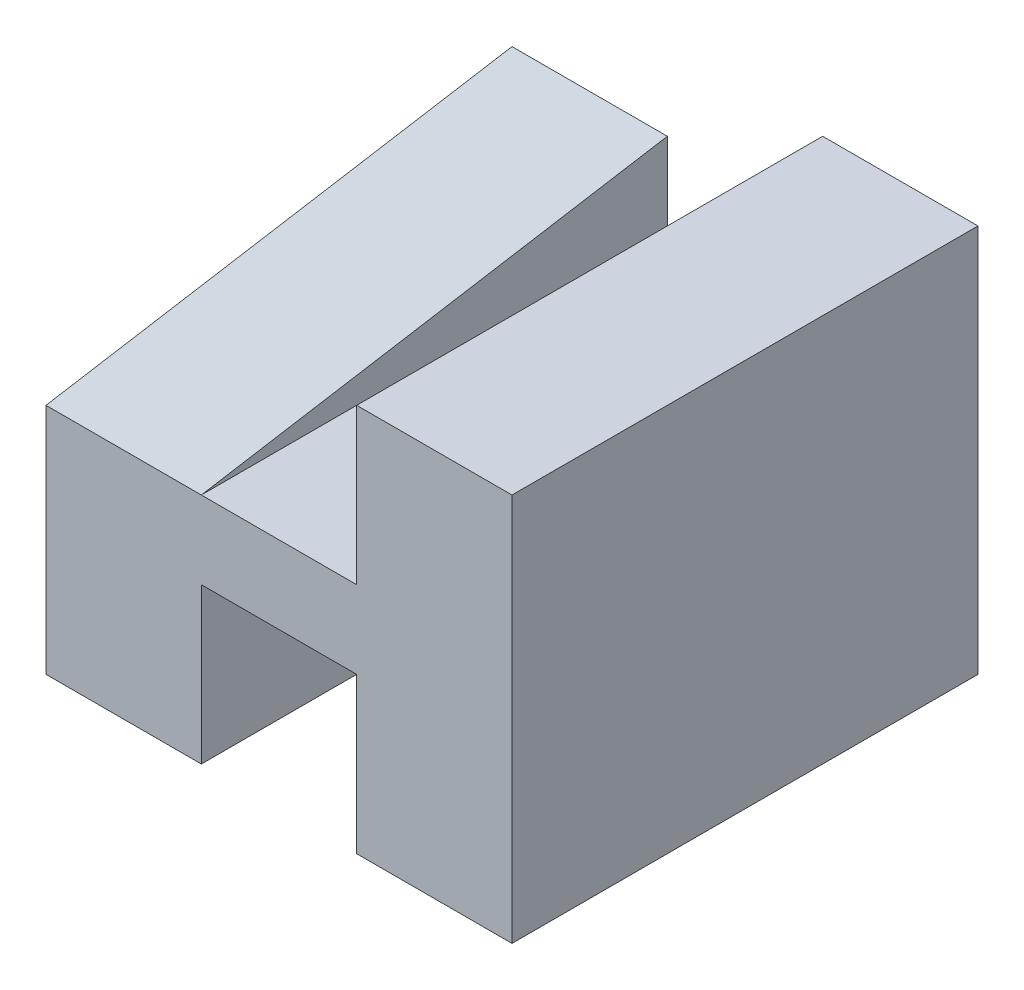
ISO-10303-21;
HEADER;
FILE_DESCRIPTION(('STEP AP214'),'2;1');
FILE_NAME('part.step','',(''),(''),'','','');
FILE_SCHEMA(('AUTOMOTIVE_DESIGN { 1 0 10303 214 1 1 1 1 }'));
ENDSEC;
DATA;
#1=APPLICATION_CONTEXT('core data for automotive mechanical design processes');
#2=APPLICATION_PROTOCOL_DEFINITION('international standard','automotive_design',2000,#1);
#3=PRODUCT_CONTEXT('',#1,'mechanical');
#4=PRODUCT('Part','Part','',(#3));
#5=PRODUCT_RELATED_PRODUCT_CATEGORY('part','',(#4));
#6=PRODUCT_DEFINITION_FORMATION('','',#4);
#7=PRODUCT_DEFINITION_CONTEXT('part definition',#1,'design');
#8=PRODUCT_DEFINITION('design','',#6,#7);
#9=PRODUCT_DEFINITION_SHAPE('','',#8);
#10=(LENGTH_UNIT() NAMED_UNIT(*) SI_UNIT(.MILLI.,.METRE.));
#11=(NAMED_UNIT(*) PLANE_ANGLE_UNIT() SI_UNIT($,.RADIAN.));
#12=(NAMED_UNIT(*) SI_UNIT($,.STERADIAN.) SOLID_ANGLE_UNIT());
#13=UNCERTAINTY_MEASURE_WITH_UNIT(LENGTH_MEASURE(1.E-05),#10,'distance_accuracy_value','');
#14=(GEOMETRIC_REPRESENTATION_CONTEXT(3) GLOBAL_UNCERTAINTY_ASSIGNED_CONTEXT((#13)) GLOBAL_UNIT_ASSIGNED_CONTEXT((#10,
#11,#12)) REPRESENTATION_CONTEXT('',''));
#15=CARTESIAN_POINT('',(0.,0.,0.));
#16=DIRECTION('',(0.,0.,1.));
#17=DIRECTION('',(1.,0.,0.));
#18=AXIS2_PLACEMENT_3D('',#15,#16,#17);
#19=CARTESIAN_POINT('',(-3.,5.,-3.));
#20=DIRECTION('',(0.,0.,1.));
#21=DIRECTION('',(1.,0.,0.));
#22=AXIS2_PLACEMENT_3D('',#19,#20,#21);
#23=PLANE('',#22);
#24=DIRECTION('',(-1.,0.,0.));
#25=VECTOR('',#24,1.);
#26=CARTESIAN_POINT('',(-1.,4.,-3.));
#27=LINE('',#26,#25);
#28=CARTESIAN_POINT('',(-1.,4.,-3.));
#29=VERTEX_POINT('',#28);
#30=CARTESIAN_POINT('',(-3.,4.,-3.));
#31=VERTEX_POINT('',#30);
#32=EDGE_CURVE('E116',#29,#31,#27,.T.);
#33=ORIENTED_EDGE('',*,*,#32,.F.);
#34=DIRECTION('',(0.,1.,0.));
#35=VECTOR('',#34,1.);
#36=CARTESIAN_POINT('',(-1.,3.,-3.));
#37=LINE('',#36,#35);
#38=CARTESIAN_POINT('',(-1.,3.,-3.));
#39=VERTEX_POINT('',#38);
#40=EDGE_CURVE('E130',#39,#29,#37,.T.);
#41=ORIENTED_EDGE('',*,*,#40,.F.);
#42=DIRECTION('',(1.,0.,0.));
#43=VECTOR('',#42,1.);
#44=CARTESIAN_POINT('',(-1.,3.,-3.));
#45=LINE('',#44,#43);
#46=CARTESIAN_POINT('',(1.,3.,-3.));
#47=VERTEX_POINT('',#46);
#48=EDGE_CURVE('E151',#39,#47,#45,.T.);
#49=ORIENTED_EDGE('',*,*,#48,.T.);
#50=DIRECTION('',(0.,1.,0.));
#51=VECTOR('',#50,1.);
#52=CARTESIAN_POINT('',(1.,3.,-3.));
#53=LINE('',#52,#51);
#54=CARTESIAN_POINT('',(1.,5.,-3.));
#55=VERTEX_POINT('',#54);
#56=EDGE_CURVE('E132',#47,#55,#53,.T.);
#57=ORIENTED_EDGE('',*,*,#56,.T.);
#58=DIRECTION('',(-1.,0.,0.));
#59=VECTOR('',#58,1.);
#60=CARTESIAN_POINT('',(-3.,5.,-3.));
#61=LINE('',#60,#59);
#62=CARTESIAN_POINT('',(3.,5.,-3.));
#63=VERTEX_POINT('',#62);
#64=EDGE_CURVE('E158',#63,#55,#61,.T.);
#65=ORIENTED_EDGE('',*,*,#64,.F.);
#66=DIRECTION('',(0.,-1.,0.));
#67=VECTOR('',#66,1.);
#68=CARTESIAN_POINT('',(3.,5.,-3.));
#69=LINE('',#68,#67);
#70=CARTESIAN_POINT('',(3.,0.,-3.));
#71=VERTEX_POINT('',#70);
#72=EDGE_CURVE('E11',#63,#71,#69,.T.);
#73=ORIENTED_EDGE('',*,*,#72,.T.);
#74=DIRECTION('',(-1.,0.,0.));
#75=VECTOR('',#74,1.);
#76=CARTESIAN_POINT('',(-3.,0.,-3.));
#77=LINE('',#76,#75);
#78=CARTESIAN_POINT('',(1.,0.,-3.));
#79=VERTEX_POINT('',#78);
#80=EDGE_CURVE('E170',#71,#79,#77,.T.);
#81=ORIENTED_EDGE('',*,*,#80,.T.);
#82=DIRECTION('',(1.,0.,0.));
#83=VECTOR('',#82,1.);
#84=CARTESIAN_POINT('',(-1.,0.,-3.));
#85=LINE('',#84,#83);
#86=CARTESIAN_POINT('',(-1.,0.,-3.));
#87=VERTEX_POINT('',#86);
#88=EDGE_CURVE('E143',#87,#79,#85,.T.);
#89=ORIENTED_EDGE('',*,*,#88,.F.);
#90=CARTESIAN_POINT('',(-3.,0.,-3.));
#91=VERTEX_POINT('',#90);
#92=EDGE_CURVE('E168',#87,#91,#77,.T.);
#93=ORIENTED_EDGE('',*,*,#92,.T.);
#94=DIRECTION('',(0.,-1.,0.));
#95=VECTOR('',#94,1.);
#96=CARTESIAN_POINT('',(-3.,5.,-3.));
#97=LINE('',#96,#95);
#98=EDGE_CURVE('E41',#31,#91,#97,.T.);
#99=ORIENTED_EDGE('',*,*,#98,.F.);
#100=EDGE_LOOP('',(#33,#41,#49,#57,#65,#73,#81,#89,#93,#99));
#101=FACE_BOUND('',#100,.T.);
#102=ADVANCED_FACE('F33',(#101),#23,.F.);
#103=CARTESIAN_POINT('',(-3.,5.,3.));
#104=DIRECTION('',(0.,0.,-1.));
#105=DIRECTION('',(-1.,0.,0.));
#106=AXIS2_PLACEMENT_3D('',#103,#104,#105);
#107=PLANE('',#106);
#108=DIRECTION('',(-1.,0.,0.));
#109=VECTOR('',#108,1.);
#110=CARTESIAN_POINT('',(-1.,3.,3.));
#111=LINE('',#110,#109);
#112=CARTESIAN_POINT('',(-1.,3.,3.));
#113=VERTEX_POINT('',#112);
#114=CARTESIAN_POINT('',(-3.,3.,3.));
#115=VERTEX_POINT('',#114);
#116=EDGE_CURVE('E119',#113,#115,#111,.T.);
#117=ORIENTED_EDGE('',*,*,#116,.T.);
#118=DIRECTION('',(0.,-1.,0.));
#119=VECTOR('',#118,1.);
#120=CARTESIAN_POINT('',(-3.,5.,3.));
#121=LINE('',#120,#119);
#122=CARTESIAN_POINT('',(-3.,0.,3.));
#123=VERTEX_POINT('',#122);
#124=EDGE_CURVE('E181',#115,#123,#121,.T.);
#125=ORIENTED_EDGE('',*,*,#124,.T.);
#126=DIRECTION('',(1.,0.,0.));
#127=VECTOR('',#126,1.);
#128=CARTESIAN_POINT('',(-3.,0.,3.));
#129=LINE('',#128,#127);
#130=CARTESIAN_POINT('',(-1.,0.,3.));
#131=VERTEX_POINT('',#130);
#132=EDGE_CURVE('E159',#123,#131,#129,.T.);
#133=ORIENTED_EDGE('',*,*,#132,.T.);
#134=DIRECTION('',(0.,-1.,0.));
#135=VECTOR('',#134,1.);
#136=CARTESIAN_POINT('',(-1.,2.,3.));
#137=LINE('',#136,#135);
#138=CARTESIAN_POINT('',(-1.,2.,3.));
#139=VERTEX_POINT('',#138);
#140=EDGE_CURVE('E198',#139,#131,#137,.T.);
#141=ORIENTED_EDGE('',*,*,#140,.F.);
#142=DIRECTION('',(1.,0.,0.));
#143=VECTOR('',#142,1.);
#144=CARTESIAN_POINT('',(-1.,2.,3.));
#145=LINE('',#144,#143);
#146=CARTESIAN_POINT('',(1.,2.,3.));
#147=VERTEX_POINT('',#146);
#148=EDGE_CURVE('E169',#139,#147,#145,.T.);
#149=ORIENTED_EDGE('',*,*,#148,.T.);
#150=DIRECTION('',(0.,-1.,0.));
#151=VECTOR('',#150,1.);
#152=CARTESIAN_POINT('',(1.,2.,3.));
#153=LINE('',#152,#151);
#154=CARTESIAN_POINT('',(1.,0.,3.));
#155=VERTEX_POINT('',#154);
#156=EDGE_CURVE('E205',#147,#155,#153,.T.);
#157=ORIENTED_EDGE('',*,*,#156,.T.);
#158=CARTESIAN_POINT('',(3.,0.,3.));
#159=VERTEX_POINT('',#158);
#160=EDGE_CURVE('E176',#155,#159,#129,.T.);
#161=ORIENTED_EDGE('',*,*,#160,.T.);
#162=DIRECTION('',(0.,-1.,0.));
#163=VECTOR('',#162,1.);
#164=CARTESIAN_POINT('',(3.,5.,3.));
#165=LINE('',#164,#163);
#166=CARTESIAN_POINT('',(3.,5.,3.));
#167=VERTEX_POINT('',#166);
#168=EDGE_CURVE('E164',#167,#159,#165,.T.);
#169=ORIENTED_EDGE('',*,*,#168,.F.);
#170=DIRECTION('',(1.,0.,0.));
#171=VECTOR('',#170,1.);
#172=CARTESIAN_POINT('',(-3.,5.,3.));
#173=LINE('',#172,#171);
#174=CARTESIAN_POINT('',(1.,5.,3.));
#175=VERTEX_POINT('',#174);
#176=EDGE_CURVE('E162',#175,#167,#173,.T.);
#177=ORIENTED_EDGE('',*,*,#176,.F.);
#178=DIRECTION('',(0.,-1.,0.));
#179=VECTOR('',#178,1.);
#180=CARTESIAN_POINT('',(1.,3.,3.));
#181=LINE('',#180,#179);
#182=CARTESIAN_POINT('',(1.,3.,3.));
#183=VERTEX_POINT('',#182);
#184=EDGE_CURVE('E48',#175,#183,#181,.T.);
#185=ORIENTED_EDGE('',*,*,#184,.T.);
#186=DIRECTION('',(1.,0.,0.));
#187=VECTOR('',#186,1.);
#188=CARTESIAN_POINT('',(-1.,3.,3.));
#189=LINE('',#188,#187);
#190=EDGE_CURVE('E138',#113,#183,#189,.T.);
#191=ORIENTED_EDGE('',*,*,#190,.F.);
#192=EDGE_LOOP('',(#117,#125,#133,#141,#149,#157,#161,#169,#177,#185,#191));
#193=FACE_BOUND('',#192,.T.);
#194=ADVANCED_FACE('F196',(#193),#107,.F.);
#195=CARTESIAN_POINT('',(-3.,5.,3.));
#196=DIRECTION('',(1.,0.,0.));
#197=DIRECTION('',(0.,0.,-1.));
#198=AXIS2_PLACEMENT_3D('',#195,#196,#197);
#199=PLANE('',#198);
#200=DIRECTION('',(0.,0.164398987305357,-0.986393923832144));
#201=VECTOR('',#200,1.);
#202=CARTESIAN_POINT('',(-3.,3.40540540540541,0.567567567567568));
#203=LINE('',#202,#201);
#204=EDGE_CURVE('E124',#115,#31,#203,.T.);
#205=ORIENTED_EDGE('',*,*,#204,.T.);
#206=ORIENTED_EDGE('',*,*,#98,.T.);
#207=DIRECTION('',(0.,0.,1.));
#208=VECTOR('',#207,1.);
#209=CARTESIAN_POINT('',(-3.,0.,3.));
#210=LINE('',#209,#208);
#211=EDGE_CURVE('E173',#91,#123,#210,.T.);
#212=ORIENTED_EDGE('',*,*,#211,.T.);
#213=ORIENTED_EDGE('',*,*,#124,.F.);
#214=EDGE_LOOP('',(#205,#206,#212,#213));
#215=FACE_BOUND('',#214,.T.);
#216=ADVANCED_FACE('F183',(#215),#199,.F.);
#217=CARTESIAN_POINT('',(-1.,0.,0.));
#218=DIRECTION('',(1.,0.,0.));
#219=DIRECTION('',(0.,0.,-1.));
#220=AXIS2_PLACEMENT_3D('',#217,#218,#219);
#221=PLANE('',#220);
#222=ORIENTED_EDGE('',*,*,#40,.T.);
#223=DIRECTION('',(0.,0.164398987305357,-0.986393923832144));
#224=VECTOR('',#223,1.);
#225=CARTESIAN_POINT('',(-1.,3.40540540540541,0.567567567567568));
#226=LINE('',#225,#224);
#227=EDGE_CURVE('E113',#113,#29,#226,.T.);
#228=ORIENTED_EDGE('',*,*,#227,.F.);
#229=DIRECTION('',(0.,0.,-1.));
#230=VECTOR('',#229,1.);
#231=CARTESIAN_POINT('',(-1.,3.,-3.));
#232=LINE('',#231,#230);
#233=EDGE_CURVE('E135',#113,#39,#232,.T.);
#234=ORIENTED_EDGE('',*,*,#233,.T.);
#235=EDGE_LOOP('',(#222,#228,#234));
#236=FACE_BOUND('',#235,.T.);
#237=ADVANCED_FACE('F134',(#236),#221,.T.);
#238=CARTESIAN_POINT('',(0.,0.,0.));
#239=DIRECTION('',(0.,-1.,0.));
#240=DIRECTION('',(0.,0.,-1.));
#241=AXIS2_PLACEMENT_3D('',#238,#239,#240);
#242=PLANE('',#241);
#243=ORIENTED_EDGE('',*,*,#160,.F.);
#244=DIRECTION('',(0.,0.,-1.));
#245=VECTOR('',#244,1.);
#246=CARTESIAN_POINT('',(1.,0.,3.));
#247=LINE('',#246,#245);
#248=EDGE_CURVE('E153',#155,#79,#247,.T.);
#249=ORIENTED_EDGE('',*,*,#248,.T.);
#250=ORIENTED_EDGE('',*,*,#80,.F.);
#251=DIRECTION('',(0.,0.,-1.));
#252=VECTOR('',#251,1.);
#253=CARTESIAN_POINT('',(3.,0.,3.));
#254=LINE('',#253,#252);
#255=EDGE_CURVE('E165',#159,#71,#254,.T.);
#256=ORIENTED_EDGE('',*,*,#255,.F.);
#257=EDGE_LOOP('',(#243,#249,#250,#256));
#258=FACE_BOUND('',#257,.T.);
#259=ADVANCED_FACE('F217',(#258),#242,.T.);
#260=CARTESIAN_POINT('',(3.,5.,3.));
#261=DIRECTION('',(-1.,0.,0.));
#262=DIRECTION('',(0.,0.,1.));
#263=AXIS2_PLACEMENT_3D('',#260,#261,#262);
#264=PLANE('',#263);
#265=ORIENTED_EDGE('',*,*,#255,.T.);
#266=ORIENTED_EDGE('',*,*,#72,.F.);
#267=DIRECTION('',(0.,0.,-1.));
#268=VECTOR('',#267,1.);
#269=CARTESIAN_POINT('',(3.,5.,3.));
#270=LINE('',#269,#268);
#271=EDGE_CURVE('E155',#167,#63,#270,.T.);
#272=ORIENTED_EDGE('',*,*,#271,.F.);
#273=ORIENTED_EDGE('',*,*,#168,.T.);
#274=EDGE_LOOP('',(#265,#266,#272,#273));
#275=FACE_BOUND('',#274,.T.);
#276=ADVANCED_FACE('F35',(#275),#264,.F.);
#277=CARTESIAN_POINT('',(0.,5.,0.));
#278=DIRECTION('',(0.,-1.,0.));
#279=DIRECTION('',(0.,0.,-1.));
#280=AXIS2_PLACEMENT_3D('',#277,#278,#279);
#281=PLANE('',#280);
#282=ORIENTED_EDGE('',*,*,#64,.T.);
#283=DIRECTION('',(0.,0.,1.));
#284=VECTOR('',#283,1.);
#285=CARTESIAN_POINT('',(1.,5.,-3.));
#286=LINE('',#285,#284);
#287=EDGE_CURVE('E148',#55,#175,#286,.T.);
#288=ORIENTED_EDGE('',*,*,#287,.T.);
#289=ORIENTED_EDGE('',*,*,#176,.T.);
#290=ORIENTED_EDGE('',*,*,#271,.T.);
#291=EDGE_LOOP('',(#282,#288,#289,#290));
#292=FACE_BOUND('',#291,.T.);
#293=ADVANCED_FACE('F250',(#292),#281,.F.);
#294=DIRECTION('',(0.,0.,-1.));
#295=VECTOR('',#294,1.);
#296=CARTESIAN_POINT('',(-1.,0.,3.));
#297=LINE('',#296,#295);
#298=EDGE_CURVE('E193',#131,#87,#297,.T.);
#299=ORIENTED_EDGE('',*,*,#298,.F.);
#300=ORIENTED_EDGE('',*,*,#132,.F.);
#301=ORIENTED_EDGE('',*,*,#211,.F.);
#302=ORIENTED_EDGE('',*,*,#92,.F.);
#303=EDGE_LOOP('',(#299,#300,#301,#302));
#304=FACE_BOUND('',#303,.T.);
#305=ADVANCED_FACE('F191',(#304),#242,.T.);
#306=CARTESIAN_POINT('',(-1.,0.,-3.));
#307=DIRECTION('',(0.,0.948683298050514,-0.316227766016838));
#308=DIRECTION('',(0.,0.316227766016838,0.948683298050514));
#309=AXIS2_PLACEMENT_3D('',#306,#307,#308);
#310=PLANE('',#309);
#311=DIRECTION('',(0.,0.316227766016838,0.948683298050514));
#312=VECTOR('',#311,1.);
#313=CARTESIAN_POINT('',(1.,0.,-3.));
#314=LINE('',#313,#312);
#315=EDGE_CURVE('E56',#79,#147,#314,.T.);
#316=ORIENTED_EDGE('',*,*,#315,.T.);
#317=ORIENTED_EDGE('',*,*,#148,.F.);
#318=DIRECTION('',(0.,0.316227766016838,0.948683298050514));
#319=VECTOR('',#318,1.);
#320=CARTESIAN_POINT('',(-1.,0.,-3.));
#321=LINE('',#320,#319);
#322=EDGE_CURVE('E204',#87,#139,#321,.T.);
#323=ORIENTED_EDGE('',*,*,#322,.F.);
#324=ORIENTED_EDGE('',*,*,#88,.T.);
#325=EDGE_LOOP('',(#316,#317,#323,#324));
#326=FACE_BOUND('',#325,.T.);
#327=ADVANCED_FACE('F214',(#326),#310,.F.);
#328=CARTESIAN_POINT('',(-1.,0.,0.));
#329=DIRECTION('',(-1.,0.,0.));
#330=DIRECTION('',(0.,0.,1.));
#331=AXIS2_PLACEMENT_3D('',#328,#329,#330);
#332=PLANE('',#331);
#333=ORIENTED_EDGE('',*,*,#298,.T.);
#334=ORIENTED_EDGE('',*,*,#322,.T.);
#335=ORIENTED_EDGE('',*,*,#140,.T.);
#336=EDGE_LOOP('',(#333,#334,#335));
#337=FACE_BOUND('',#336,.T.);
#338=ADVANCED_FACE('F227',(#337),#332,.F.);
#339=CARTESIAN_POINT('',(1.,0.,0.));
#340=DIRECTION('',(-1.,0.,0.));
#341=DIRECTION('',(0.,0.,1.));
#342=AXIS2_PLACEMENT_3D('',#339,#340,#341);
#343=PLANE('',#342);
#344=ORIENTED_EDGE('',*,*,#248,.F.);
#345=ORIENTED_EDGE('',*,*,#156,.F.);
#346=ORIENTED_EDGE('',*,*,#315,.F.);
#347=EDGE_LOOP('',(#344,#345,#346));
#348=FACE_BOUND('',#347,.T.);
#349=ADVANCED_FACE('F224',(#348),#343,.T.);
#350=CARTESIAN_POINT('',(-1.,3.,-3.));
#351=DIRECTION('',(0.,-1.,0.));
#352=DIRECTION('',(0.,0.,-1.));
#353=AXIS2_PLACEMENT_3D('',#350,#351,#352);
#354=PLANE('',#353);
#355=DIRECTION('',(0.,0.,-1.));
#356=VECTOR('',#355,1.);
#357=CARTESIAN_POINT('',(1.,3.,-3.));
#358=LINE('',#357,#356);
#359=EDGE_CURVE('E136',#183,#47,#358,.T.);
#360=ORIENTED_EDGE('',*,*,#359,.T.);
#361=ORIENTED_EDGE('',*,*,#48,.F.);
#362=ORIENTED_EDGE('',*,*,#233,.F.);
#363=ORIENTED_EDGE('',*,*,#190,.T.);
#364=EDGE_LOOP('',(#360,#361,#362,#363));
#365=FACE_BOUND('',#364,.T.);
#366=ADVANCED_FACE('F226',(#365),#354,.F.);
#367=CARTESIAN_POINT('',(1.,0.,0.));
#368=DIRECTION('',(1.,0.,0.));
#369=DIRECTION('',(0.,0.,-1.));
#370=AXIS2_PLACEMENT_3D('',#367,#368,#369);
#371=PLANE('',#370);
#372=ORIENTED_EDGE('',*,*,#56,.F.);
#373=ORIENTED_EDGE('',*,*,#359,.F.);
#374=ORIENTED_EDGE('',*,*,#184,.F.);
#375=ORIENTED_EDGE('',*,*,#287,.F.);
#376=EDGE_LOOP('',(#372,#373,#374,#375));
#377=FACE_BOUND('',#376,.T.);
#378=ADVANCED_FACE('F233',(#377),#371,.F.);
#379=CARTESIAN_POINT('',(-1.,3.40540540540541,0.567567567567568));
#380=DIRECTION('',(0.,0.986393923832144,0.164398987305357));
#381=DIRECTION('',(0.,-0.164398987305357,0.986393923832144));
#382=AXIS2_PLACEMENT_3D('',#379,#380,#381);
#383=PLANE('',#382);
#384=ORIENTED_EDGE('',*,*,#204,.F.);
#385=ORIENTED_EDGE('',*,*,#116,.F.);
#386=ORIENTED_EDGE('',*,*,#227,.T.);
#387=ORIENTED_EDGE('',*,*,#32,.T.);
#388=EDGE_LOOP('',(#384,#385,#386,#387));
#389=FACE_BOUND('',#388,.T.);
#390=ADVANCED_FACE('F115',(#389),#383,.T.);
#391=CLOSED_SHELL('',(#102,#194,#216,#237,#259,#276,#293,#305,#327,#338,#349,#366,#378,#390));
#392=MANIFOLD_SOLID_BREP('B2',#391);
#393=ADVANCED_BREP_SHAPE_REPRESENTATION('',(#18,#392),#14);
#394=SHAPE_DEFINITION_REPRESENTATION(#9,#393);
ENDSEC;
END-ISO-10303-21;
